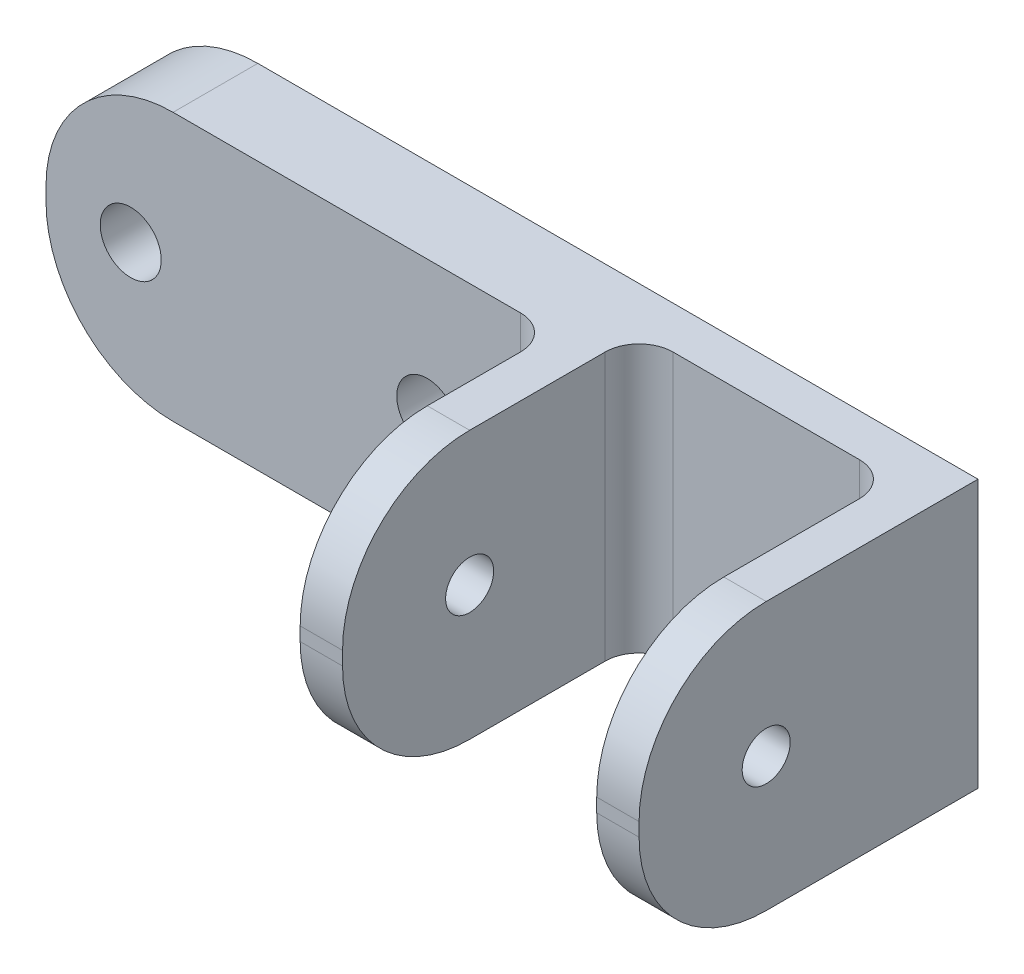
ISO-10303-21;
HEADER;
FILE_DESCRIPTION(('STEP AP214'),'2;1');
FILE_NAME('part.step','',(''),(''),'','','');
FILE_SCHEMA(('AUTOMOTIVE_DESIGN { 1 0 10303 214 1 1 1 1 }'));
ENDSEC;
DATA;
#1=APPLICATION_CONTEXT('core data for automotive mechanical design processes');
#2=APPLICATION_PROTOCOL_DEFINITION('international standard','automotive_design',2000,#1);
#3=PRODUCT_CONTEXT('',#1,'mechanical');
#4=PRODUCT('Part','Part','',(#3));
#5=PRODUCT_RELATED_PRODUCT_CATEGORY('part','',(#4));
#6=PRODUCT_DEFINITION_FORMATION('','',#4);
#7=PRODUCT_DEFINITION_CONTEXT('part definition',#1,'design');
#8=PRODUCT_DEFINITION('design','',#6,#7);
#9=PRODUCT_DEFINITION_SHAPE('','',#8);
#10=(LENGTH_UNIT() NAMED_UNIT(*) SI_UNIT(.MILLI.,.METRE.));
#11=(NAMED_UNIT(*) PLANE_ANGLE_UNIT() SI_UNIT($,.RADIAN.));
#12=(NAMED_UNIT(*) SI_UNIT($,.STERADIAN.) SOLID_ANGLE_UNIT());
#13=UNCERTAINTY_MEASURE_WITH_UNIT(LENGTH_MEASURE(1.E-05),#10,'distance_accuracy_value','');
#14=(GEOMETRIC_REPRESENTATION_CONTEXT(3) GLOBAL_UNCERTAINTY_ASSIGNED_CONTEXT((#13)) GLOBAL_UNIT_ASSIGNED_CONTEXT((#10,
#11,#12)) REPRESENTATION_CONTEXT('',''));
#15=CARTESIAN_POINT('',(0.,0.,0.));
#16=DIRECTION('',(0.,0.,1.));
#17=DIRECTION('',(1.,0.,0.));
#18=AXIS2_PLACEMENT_3D('',#15,#16,#17);
#19=CARTESIAN_POINT('',(0.,0.,6.35));
#20=DIRECTION('',(0.,0.,-1.));
#21=DIRECTION('',(-1.,0.,0.));
#22=AXIS2_PLACEMENT_3D('',#19,#20,#21);
#23=PLANE('',#22);
#24=CARTESIAN_POINT('',(-3.17500000000002,0.,6.35));
#25=DIRECTION('',(0.,0.,1.));
#26=DIRECTION('',(1.,0.,0.));
#27=AXIS2_PLACEMENT_3D('',#24,#25,#26);
#28=CIRCLE('',#27,2.286);
#29=CARTESIAN_POINT('',(-0.889000000000021,0.,6.35));
#30=VERTEX_POINT('',#29);
#31=EDGE_CURVE('E451',#30,#30,#28,.T.);
#32=ORIENTED_EDGE('',*,*,#31,.F.);
#33=EDGE_LOOP('',(#32));
#34=FACE_BOUND('',#33,.T.);
#35=CARTESIAN_POINT('',(-25.4,0.,6.35));
#36=DIRECTION('',(0.,0.,1.));
#37=DIRECTION('',(1.,0.,0.));
#38=AXIS2_PLACEMENT_3D('',#35,#36,#37);
#39=CIRCLE('',#38,2.286);
#40=CARTESIAN_POINT('',(-23.114,0.,6.35));
#41=VERTEX_POINT('',#40);
#42=EDGE_CURVE('E444',#41,#41,#39,.T.);
#43=ORIENTED_EDGE('',*,*,#42,.F.);
#44=EDGE_LOOP('',(#43));
#45=FACE_BOUND('',#44,.T.);
#46=DIRECTION('',(0.,-1.,0.));
#47=VECTOR('',#46,1.);
#48=CARTESIAN_POINT('',(-31.75,-10.033,6.35));
#49=LINE('',#48,#47);
#50=CARTESIAN_POINT('',(-31.75,0.508,6.35));
#51=VERTEX_POINT('',#50);
#52=CARTESIAN_POINT('',(-31.75,-0.508,6.35));
#53=VERTEX_POINT('',#52);
#54=EDGE_CURVE('E306',#51,#53,#49,.T.);
#55=ORIENTED_EDGE('',*,*,#54,.T.);
#56=CARTESIAN_POINT('',(-22.225,-0.508,6.35));
#57=DIRECTION('',(0.,0.,-1.));
#58=DIRECTION('',(-1.,0.,0.));
#59=AXIS2_PLACEMENT_3D('',#56,#57,#58);
#60=CIRCLE('',#59,9.525);
#61=CARTESIAN_POINT('',(-22.225,-10.033,6.35));
#62=VERTEX_POINT('',#61);
#63=EDGE_CURVE('E258',#53,#62,#60,.F.);
#64=ORIENTED_EDGE('',*,*,#63,.T.);
#65=DIRECTION('',(1.,0.,0.));
#66=VECTOR('',#65,1.);
#67=CARTESIAN_POINT('',(-31.75,-10.033,6.35));
#68=LINE('',#67,#66);
#69=CARTESIAN_POINT('',(3.80999999999998,-10.033,6.35));
#70=VERTEX_POINT('',#69);
#71=EDGE_CURVE('E196',#62,#70,#68,.T.);
#72=ORIENTED_EDGE('',*,*,#71,.T.);
#73=DIRECTION('',(0.,-1.,0.));
#74=VECTOR('',#73,1.);
#75=CARTESIAN_POINT('',(3.80999999999998,10.033,6.35));
#76=LINE('',#75,#74);
#77=CARTESIAN_POINT('',(3.80999999999998,10.033,6.35));
#78=VERTEX_POINT('',#77);
#79=EDGE_CURVE('E224',#70,#78,#76,.F.);
#80=ORIENTED_EDGE('',*,*,#79,.T.);
#81=DIRECTION('',(-1.,0.,0.));
#82=VECTOR('',#81,1.);
#83=CARTESIAN_POINT('',(-31.75,10.033,6.35));
#84=LINE('',#83,#82);
#85=CARTESIAN_POINT('',(-22.225,10.033,6.35));
#86=VERTEX_POINT('',#85);
#87=EDGE_CURVE('E203',#78,#86,#84,.T.);
#88=ORIENTED_EDGE('',*,*,#87,.T.);
#89=CARTESIAN_POINT('',(-22.225,0.508,6.35));
#90=DIRECTION('',(0.,0.,-1.));
#91=DIRECTION('',(-1.,0.,0.));
#92=AXIS2_PLACEMENT_3D('',#89,#90,#91);
#93=CIRCLE('',#92,9.525);
#94=EDGE_CURVE('E256',#86,#51,#93,.F.);
#95=ORIENTED_EDGE('',*,*,#94,.T.);
#96=EDGE_LOOP('',(#55,#64,#72,#80,#88,#95));
#97=FACE_BOUND('',#96,.T.);
#98=ADVANCED_FACE('F33',(#34,#45,#97),#23,.F.);
#99=CARTESIAN_POINT('',(31.75,-10.033,6.35));
#100=DIRECTION('',(-1.,0.,0.));
#101=DIRECTION('',(0.,0.,1.));
#102=AXIS2_PLACEMENT_3D('',#99,#100,#101);
#103=PLANE('',#102);
#104=CARTESIAN_POINT('',(31.75,0.,15.875));
#105=DIRECTION('',(-1.,0.,0.));
#106=DIRECTION('',(0.,0.,1.));
#107=AXIS2_PLACEMENT_3D('',#104,#105,#106);
#108=CIRCLE('',#107,1.8);
#109=CARTESIAN_POINT('',(31.75,0.,17.675));
#110=VERTEX_POINT('',#109);
#111=EDGE_CURVE('E209',#110,#110,#108,.T.);
#112=ORIENTED_EDGE('',*,*,#111,.T.);
#113=EDGE_LOOP('',(#112));
#114=FACE_BOUND('',#113,.T.);
#115=DIRECTION('',(0.,-1.,0.));
#116=VECTOR('',#115,1.);
#117=CARTESIAN_POINT('',(31.75,-10.033,25.4));
#118=LINE('',#117,#116);
#119=CARTESIAN_POINT('',(31.75,0.508,25.4));
#120=VERTEX_POINT('',#119);
#121=CARTESIAN_POINT('',(31.75,-0.508,25.4));
#122=VERTEX_POINT('',#121);
#123=EDGE_CURVE('E293',#120,#122,#118,.T.);
#124=ORIENTED_EDGE('',*,*,#123,.T.);
#125=CARTESIAN_POINT('',(31.75,-0.508,15.875));
#126=DIRECTION('',(-1.,0.,0.));
#127=DIRECTION('',(0.,0.,1.));
#128=AXIS2_PLACEMENT_3D('',#125,#126,#127);
#129=CIRCLE('',#128,9.525);
#130=CARTESIAN_POINT('',(31.75,-10.033,15.875));
#131=VERTEX_POINT('',#130);
#132=EDGE_CURVE('E285',#122,#131,#129,.F.);
#133=ORIENTED_EDGE('',*,*,#132,.T.);
#134=DIRECTION('',(0.,0.,-1.));
#135=VECTOR('',#134,1.);
#136=CARTESIAN_POINT('',(31.75,-10.033,6.35));
#137=LINE('',#136,#135);
#138=CARTESIAN_POINT('',(31.75,-10.033,0.));
#139=VERTEX_POINT('',#138);
#140=EDGE_CURVE('E176',#131,#139,#137,.T.);
#141=ORIENTED_EDGE('',*,*,#140,.T.);
#142=DIRECTION('',(0.,1.,0.));
#143=VECTOR('',#142,1.);
#144=CARTESIAN_POINT('',(31.75,-10.033,0.));
#145=LINE('',#144,#143);
#146=CARTESIAN_POINT('',(31.75,10.033,0.));
#147=VERTEX_POINT('',#146);
#148=EDGE_CURVE('E182',#139,#147,#145,.T.);
#149=ORIENTED_EDGE('',*,*,#148,.T.);
#150=DIRECTION('',(0.,0.,-1.));
#151=VECTOR('',#150,1.);
#152=CARTESIAN_POINT('',(31.75,10.033,6.35));
#153=LINE('',#152,#151);
#154=CARTESIAN_POINT('',(31.75,10.033,15.875));
#155=VERTEX_POINT('',#154);
#156=EDGE_CURVE('E165',#155,#147,#153,.T.);
#157=ORIENTED_EDGE('',*,*,#156,.F.);
#158=CARTESIAN_POINT('',(31.75,0.508,15.875));
#159=DIRECTION('',(-1.,0.,0.));
#160=DIRECTION('',(0.,0.,1.));
#161=AXIS2_PLACEMENT_3D('',#158,#159,#160);
#162=CIRCLE('',#161,9.525);
#163=EDGE_CURVE('E283',#155,#120,#162,.F.);
#164=ORIENTED_EDGE('',*,*,#163,.T.);
#165=EDGE_LOOP('',(#124,#133,#141,#149,#157,#164));
#166=FACE_BOUND('',#165,.T.);
#167=ADVANCED_FACE('F188',(#114,#166),#103,.F.);
#168=CARTESIAN_POINT('',(-31.75,10.033,6.35));
#169=DIRECTION('',(0.,-1.,0.));
#170=DIRECTION('',(0.,0.,-1.));
#171=AXIS2_PLACEMENT_3D('',#168,#169,#170);
#172=PLANE('',#171);
#173=DIRECTION('',(-1.,0.,0.));
#174=VECTOR('',#173,1.);
#175=CARTESIAN_POINT('',(-31.75,10.033,0.));
#176=LINE('',#175,#174);
#177=CARTESIAN_POINT('',(-22.225,10.033,0.));
#178=VERTEX_POINT('',#177);
#179=EDGE_CURVE('E168',#147,#178,#176,.T.);
#180=ORIENTED_EDGE('',*,*,#179,.T.);
#181=DIRECTION('',(0.,0.,-1.));
#182=VECTOR('',#181,1.);
#183=CARTESIAN_POINT('',(-22.225,10.033,6.35));
#184=LINE('',#183,#182);
#185=EDGE_CURVE('E263',#178,#86,#184,.F.);
#186=ORIENTED_EDGE('',*,*,#185,.T.);
#187=ORIENTED_EDGE('',*,*,#87,.F.);
#188=CARTESIAN_POINT('',(3.80999999999998,10.033,8.89));
#189=DIRECTION('',(0.,-1.,0.));
#190=DIRECTION('',(0.,0.,-1.));
#191=AXIS2_PLACEMENT_3D('',#188,#189,#190);
#192=CIRCLE('',#191,2.54);
#193=CARTESIAN_POINT('',(6.34999999999998,10.033,8.89));
#194=VERTEX_POINT('',#193);
#195=EDGE_CURVE('E238',#78,#194,#192,.T.);
#196=ORIENTED_EDGE('',*,*,#195,.T.);
#197=DIRECTION('',(0.,0.,-1.));
#198=VECTOR('',#197,1.);
#199=CARTESIAN_POINT('',(6.34999999999998,10.033,45.7156339059356));
#200=LINE('',#199,#198);
#201=CARTESIAN_POINT('',(6.34999999999998,10.033,15.875));
#202=VERTEX_POINT('',#201);
#203=EDGE_CURVE('E325',#202,#194,#200,.T.);
#204=ORIENTED_EDGE('',*,*,#203,.F.);
#205=DIRECTION('',(-1.,0.,0.));
#206=VECTOR('',#205,1.);
#207=CARTESIAN_POINT('',(9.52499999999998,10.033,15.875));
#208=LINE('',#207,#206);
#209=CARTESIAN_POINT('',(9.52499999999998,10.033,15.875));
#210=VERTEX_POINT('',#209);
#211=EDGE_CURVE('E260',#202,#210,#208,.F.);
#212=ORIENTED_EDGE('',*,*,#211,.T.);
#213=DIRECTION('',(0.,0.,-1.));
#214=VECTOR('',#213,1.);
#215=CARTESIAN_POINT('',(9.52499999999998,10.033,45.7156339059356));
#216=LINE('',#215,#214);
#217=CARTESIAN_POINT('',(9.52499999999998,10.033,5.715));
#218=VERTEX_POINT('',#217);
#219=EDGE_CURVE('E421',#210,#218,#216,.T.);
#220=ORIENTED_EDGE('',*,*,#219,.T.);
#221=CARTESIAN_POINT('',(12.065,10.033,5.715));
#222=DIRECTION('',(0.,-1.,0.));
#223=DIRECTION('',(0.,0.,-1.));
#224=AXIS2_PLACEMENT_3D('',#221,#222,#223);
#225=CIRCLE('',#224,2.54);
#226=CARTESIAN_POINT('',(12.065,10.033,3.175));
#227=VERTEX_POINT('',#226);
#228=EDGE_CURVE('E233',#218,#227,#225,.T.);
#229=ORIENTED_EDGE('',*,*,#228,.T.);
#230=DIRECTION('',(-1.,0.,0.));
#231=VECTOR('',#230,1.);
#232=CARTESIAN_POINT('',(28.575,10.033,3.175));
#233=LINE('',#232,#231);
#234=CARTESIAN_POINT('',(26.035,10.033,3.175));
#235=VERTEX_POINT('',#234);
#236=EDGE_CURVE('E458',#235,#227,#233,.T.);
#237=ORIENTED_EDGE('',*,*,#236,.F.);
#238=CARTESIAN_POINT('',(26.035,10.033,5.715));
#239=DIRECTION('',(0.,-1.,0.));
#240=DIRECTION('',(0.,0.,-1.));
#241=AXIS2_PLACEMENT_3D('',#238,#239,#240);
#242=CIRCLE('',#241,2.54);
#243=CARTESIAN_POINT('',(28.575,10.033,5.715));
#244=VERTEX_POINT('',#243);
#245=EDGE_CURVE('E226',#235,#244,#242,.T.);
#246=ORIENTED_EDGE('',*,*,#245,.T.);
#247=DIRECTION('',(0.,0.,1.));
#248=VECTOR('',#247,1.);
#249=CARTESIAN_POINT('',(28.575,10.033,0.));
#250=LINE('',#249,#248);
#251=CARTESIAN_POINT('',(28.575,10.033,15.875));
#252=VERTEX_POINT('',#251);
#253=EDGE_CURVE('E289',#244,#252,#250,.T.);
#254=ORIENTED_EDGE('',*,*,#253,.T.);
#255=DIRECTION('',(1.,0.,0.));
#256=VECTOR('',#255,1.);
#257=CARTESIAN_POINT('',(31.75,10.033,15.875));
#258=LINE('',#257,#256);
#259=EDGE_CURVE('E172',#252,#155,#258,.T.);
#260=ORIENTED_EDGE('',*,*,#259,.T.);
#261=ORIENTED_EDGE('',*,*,#156,.T.);
#262=EDGE_LOOP('',(#180,#186,#187,#196,#204,#212,#220,#229,#237,#246,#254,#260,#261));
#263=FACE_BOUND('',#262,.T.);
#264=ADVANCED_FACE('F167',(#263),#172,.F.);
#265=CARTESIAN_POINT('',(-31.75,-10.033,6.35));
#266=DIRECTION('',(1.,0.,0.));
#267=DIRECTION('',(0.,0.,-1.));
#268=AXIS2_PLACEMENT_3D('',#265,#266,#267);
#269=PLANE('',#268);
#270=DIRECTION('',(0.,-1.,0.));
#271=VECTOR('',#270,1.);
#272=CARTESIAN_POINT('',(-31.75,-10.033,0.));
#273=LINE('',#272,#271);
#274=CARTESIAN_POINT('',(-31.75,0.508,0.));
#275=VERTEX_POINT('',#274);
#276=CARTESIAN_POINT('',(-31.75,-0.508,0.));
#277=VERTEX_POINT('',#276);
#278=EDGE_CURVE('E185',#275,#277,#273,.T.);
#279=ORIENTED_EDGE('',*,*,#278,.T.);
#280=DIRECTION('',(0.,0.,-1.));
#281=VECTOR('',#280,1.);
#282=CARTESIAN_POINT('',(-31.75,-0.508,6.35));
#283=LINE('',#282,#281);
#284=EDGE_CURVE('E254',#277,#53,#283,.F.);
#285=ORIENTED_EDGE('',*,*,#284,.T.);
#286=ORIENTED_EDGE('',*,*,#54,.F.);
#287=DIRECTION('',(0.,0.,-1.));
#288=VECTOR('',#287,1.);
#289=CARTESIAN_POINT('',(-31.75,0.508,6.35));
#290=LINE('',#289,#288);
#291=EDGE_CURVE('E251',#51,#275,#290,.T.);
#292=ORIENTED_EDGE('',*,*,#291,.T.);
#293=EDGE_LOOP('',(#279,#285,#286,#292));
#294=FACE_BOUND('',#293,.T.);
#295=ADVANCED_FACE('F332',(#294),#269,.F.);
#296=CARTESIAN_POINT('',(-31.75,-10.033,6.35));
#297=DIRECTION('',(0.,1.,0.));
#298=DIRECTION('',(0.,0.,1.));
#299=AXIS2_PLACEMENT_3D('',#296,#297,#298);
#300=PLANE('',#299);
#301=ORIENTED_EDGE('',*,*,#71,.F.);
#302=DIRECTION('',(0.,0.,-1.));
#303=VECTOR('',#302,1.);
#304=CARTESIAN_POINT('',(-22.225,-10.033,6.35));
#305=LINE('',#304,#303);
#306=CARTESIAN_POINT('',(-22.225,-10.033,0.));
#307=VERTEX_POINT('',#306);
#308=EDGE_CURVE('E245',#62,#307,#305,.T.);
#309=ORIENTED_EDGE('',*,*,#308,.T.);
#310=DIRECTION('',(1.,0.,0.));
#311=VECTOR('',#310,1.);
#312=CARTESIAN_POINT('',(-31.75,-10.033,0.));
#313=LINE('',#312,#311);
#314=EDGE_CURVE('E201',#307,#139,#313,.T.);
#315=ORIENTED_EDGE('',*,*,#314,.T.);
#316=ORIENTED_EDGE('',*,*,#140,.F.);
#317=DIRECTION('',(1.,0.,0.));
#318=VECTOR('',#317,1.);
#319=CARTESIAN_POINT('',(28.575,-10.033,15.875));
#320=LINE('',#319,#318);
#321=CARTESIAN_POINT('',(28.575,-10.033,15.875));
#322=VERTEX_POINT('',#321);
#323=EDGE_CURVE('E241',#131,#322,#320,.F.);
#324=ORIENTED_EDGE('',*,*,#323,.T.);
#325=DIRECTION('',(0.,0.,-1.));
#326=VECTOR('',#325,1.);
#327=CARTESIAN_POINT('',(28.575,-10.033,0.));
#328=LINE('',#327,#326);
#329=CARTESIAN_POINT('',(28.575,-10.033,5.715));
#330=VERTEX_POINT('',#329);
#331=EDGE_CURVE('E191',#322,#330,#328,.T.);
#332=ORIENTED_EDGE('',*,*,#331,.T.);
#333=CARTESIAN_POINT('',(26.035,-10.033,5.715));
#334=DIRECTION('',(0.,1.,0.));
#335=DIRECTION('',(0.,0.,1.));
#336=AXIS2_PLACEMENT_3D('',#333,#334,#335);
#337=CIRCLE('',#336,2.54);
#338=CARTESIAN_POINT('',(26.035,-10.033,3.175));
#339=VERTEX_POINT('',#338);
#340=EDGE_CURVE('E228',#330,#339,#337,.T.);
#341=ORIENTED_EDGE('',*,*,#340,.T.);
#342=DIRECTION('',(1.,0.,0.));
#343=VECTOR('',#342,1.);
#344=CARTESIAN_POINT('',(9.52499999999998,-10.033,3.175));
#345=LINE('',#344,#343);
#346=CARTESIAN_POINT('',(12.065,-10.033,3.175));
#347=VERTEX_POINT('',#346);
#348=EDGE_CURVE('E448',#347,#339,#345,.T.);
#349=ORIENTED_EDGE('',*,*,#348,.F.);
#350=CARTESIAN_POINT('',(12.065,-10.033,5.715));
#351=DIRECTION('',(0.,1.,0.));
#352=DIRECTION('',(0.,0.,1.));
#353=AXIS2_PLACEMENT_3D('',#350,#351,#352);
#354=CIRCLE('',#353,2.54);
#355=CARTESIAN_POINT('',(9.52499999999998,-10.033,5.715));
#356=VERTEX_POINT('',#355);
#357=EDGE_CURVE('E230',#347,#356,#354,.T.);
#358=ORIENTED_EDGE('',*,*,#357,.T.);
#359=DIRECTION('',(0.,0.,-1.));
#360=VECTOR('',#359,1.);
#361=CARTESIAN_POINT('',(9.52499999999998,-10.033,45.7156339059356));
#362=LINE('',#361,#360);
#363=CARTESIAN_POINT('',(9.52499999999998,-10.033,15.875));
#364=VERTEX_POINT('',#363);
#365=EDGE_CURVE('E431',#364,#356,#362,.T.);
#366=ORIENTED_EDGE('',*,*,#365,.F.);
#367=DIRECTION('',(1.,0.,0.));
#368=VECTOR('',#367,1.);
#369=CARTESIAN_POINT('',(6.34999999999998,-10.033,15.875));
#370=LINE('',#369,#368);
#371=CARTESIAN_POINT('',(6.34999999999998,-10.033,15.875));
#372=VERTEX_POINT('',#371);
#373=EDGE_CURVE('E243',#364,#372,#370,.F.);
#374=ORIENTED_EDGE('',*,*,#373,.T.);
#375=DIRECTION('',(0.,0.,-1.));
#376=VECTOR('',#375,1.);
#377=CARTESIAN_POINT('',(6.34999999999998,-10.033,45.7156339059356));
#378=LINE('',#377,#376);
#379=CARTESIAN_POINT('',(6.34999999999998,-10.033,8.89));
#380=VERTEX_POINT('',#379);
#381=EDGE_CURVE('E319',#372,#380,#378,.T.);
#382=ORIENTED_EDGE('',*,*,#381,.T.);
#383=CARTESIAN_POINT('',(3.80999999999998,-10.033,8.89));
#384=DIRECTION('',(0.,1.,0.));
#385=DIRECTION('',(0.,0.,1.));
#386=AXIS2_PLACEMENT_3D('',#383,#384,#385);
#387=CIRCLE('',#386,2.54);
#388=EDGE_CURVE('E235',#380,#70,#387,.T.);
#389=ORIENTED_EDGE('',*,*,#388,.T.);
#390=EDGE_LOOP('',(#301,#309,#315,#316,#324,#332,#341,#349,#358,#366,#374,#382,#389));
#391=FACE_BOUND('',#390,.T.);
#392=ADVANCED_FACE('F317',(#391),#300,.F.);
#393=CARTESIAN_POINT('',(0.,0.,0.));
#394=DIRECTION('',(0.,0.,-1.));
#395=DIRECTION('',(-1.,0.,0.));
#396=AXIS2_PLACEMENT_3D('',#393,#394,#395);
#397=PLANE('',#396);
#398=CARTESIAN_POINT('',(-3.17500000000002,0.,0.));
#399=DIRECTION('',(0.,0.,1.));
#400=DIRECTION('',(1.,0.,0.));
#401=AXIS2_PLACEMENT_3D('',#398,#399,#400);
#402=CIRCLE('',#401,2.286);
#403=CARTESIAN_POINT('',(-0.889000000000021,0.,0.));
#404=VERTEX_POINT('',#403);
#405=EDGE_CURVE('E443',#404,#404,#402,.T.);
#406=ORIENTED_EDGE('',*,*,#405,.T.);
#407=EDGE_LOOP('',(#406));
#408=FACE_BOUND('',#407,.T.);
#409=CARTESIAN_POINT('',(-25.4,0.,0.));
#410=DIRECTION('',(0.,0.,1.));
#411=DIRECTION('',(1.,0.,0.));
#412=AXIS2_PLACEMENT_3D('',#409,#410,#411);
#413=CIRCLE('',#412,2.286);
#414=CARTESIAN_POINT('',(-23.114,0.,0.));
#415=VERTEX_POINT('',#414);
#416=EDGE_CURVE('E447',#415,#415,#413,.T.);
#417=ORIENTED_EDGE('',*,*,#416,.T.);
#418=EDGE_LOOP('',(#417));
#419=FACE_BOUND('',#418,.T.);
#420=ORIENTED_EDGE('',*,*,#314,.F.);
#421=CARTESIAN_POINT('',(-22.225,-0.508,0.));
#422=DIRECTION('',(0.,0.,-1.));
#423=DIRECTION('',(-1.,0.,0.));
#424=AXIS2_PLACEMENT_3D('',#421,#422,#423);
#425=CIRCLE('',#424,9.525);
#426=EDGE_CURVE('E249',#307,#277,#425,.T.);
#427=ORIENTED_EDGE('',*,*,#426,.T.);
#428=ORIENTED_EDGE('',*,*,#278,.F.);
#429=CARTESIAN_POINT('',(-22.225,0.508,0.));
#430=DIRECTION('',(0.,0.,-1.));
#431=DIRECTION('',(-1.,0.,0.));
#432=AXIS2_PLACEMENT_3D('',#429,#430,#431);
#433=CIRCLE('',#432,9.525);
#434=EDGE_CURVE('E184',#275,#178,#433,.T.);
#435=ORIENTED_EDGE('',*,*,#434,.T.);
#436=ORIENTED_EDGE('',*,*,#179,.F.);
#437=ORIENTED_EDGE('',*,*,#148,.F.);
#438=EDGE_LOOP('',(#420,#427,#428,#435,#436,#437));
#439=FACE_BOUND('',#438,.T.);
#440=ADVANCED_FACE('F181',(#408,#419,#439),#397,.T.);
#441=CARTESIAN_POINT('',(28.575,0.,0.));
#442=DIRECTION('',(1.,0.,0.));
#443=DIRECTION('',(0.,0.,-1.));
#444=AXIS2_PLACEMENT_3D('',#441,#442,#443);
#445=PLANE('',#444);
#446=CARTESIAN_POINT('',(28.575,0.,15.875));
#447=DIRECTION('',(1.,0.,0.));
#448=DIRECTION('',(0.,0.,-1.));
#449=AXIS2_PLACEMENT_3D('',#446,#447,#448);
#450=CIRCLE('',#449,1.8);
#451=CARTESIAN_POINT('',(28.575,0.,14.075));
#452=VERTEX_POINT('',#451);
#453=EDGE_CURVE('E433',#452,#452,#450,.T.);
#454=ORIENTED_EDGE('',*,*,#453,.T.);
#455=EDGE_LOOP('',(#454));
#456=FACE_BOUND('',#455,.T.);
#457=ORIENTED_EDGE('',*,*,#331,.F.);
#458=CARTESIAN_POINT('',(28.575,-0.508,15.875));
#459=DIRECTION('',(1.,0.,0.));
#460=DIRECTION('',(0.,0.,-1.));
#461=AXIS2_PLACEMENT_3D('',#458,#459,#460);
#462=CIRCLE('',#461,9.525);
#463=CARTESIAN_POINT('',(28.575,-0.508,25.4));
#464=VERTEX_POINT('',#463);
#465=EDGE_CURVE('E11',#322,#464,#462,.F.);
#466=ORIENTED_EDGE('',*,*,#465,.T.);
#467=DIRECTION('',(0.,-1.,0.));
#468=VECTOR('',#467,1.);
#469=CARTESIAN_POINT('',(28.575,-10.033,25.4));
#470=LINE('',#469,#468);
#471=CARTESIAN_POINT('',(28.575,0.508,25.4));
#472=VERTEX_POINT('',#471);
#473=EDGE_CURVE('E193',#472,#464,#470,.T.);
#474=ORIENTED_EDGE('',*,*,#473,.F.);
#475=CARTESIAN_POINT('',(28.575,0.508,15.875));
#476=DIRECTION('',(1.,0.,0.));
#477=DIRECTION('',(0.,0.,-1.));
#478=AXIS2_PLACEMENT_3D('',#475,#476,#477);
#479=CIRCLE('',#478,9.525);
#480=EDGE_CURVE('E41',#472,#252,#479,.F.);
#481=ORIENTED_EDGE('',*,*,#480,.T.);
#482=ORIENTED_EDGE('',*,*,#253,.F.);
#483=DIRECTION('',(0.,1.,0.));
#484=VECTOR('',#483,1.);
#485=CARTESIAN_POINT('',(28.575,0.,5.715));
#486=LINE('',#485,#484);
#487=EDGE_CURVE('E215',#244,#330,#486,.F.);
#488=ORIENTED_EDGE('',*,*,#487,.T.);
#489=EDGE_LOOP('',(#457,#466,#474,#481,#482,#488));
#490=FACE_BOUND('',#489,.T.);
#491=ADVANCED_FACE('F288',(#456,#490),#445,.F.);
#492=CARTESIAN_POINT('',(28.575,-10.033,25.4));
#493=DIRECTION('',(0.,0.,1.));
#494=DIRECTION('',(1.,0.,0.));
#495=AXIS2_PLACEMENT_3D('',#492,#493,#494);
#496=PLANE('',#495);
#497=ORIENTED_EDGE('',*,*,#473,.T.);
#498=DIRECTION('',(1.,0.,0.));
#499=VECTOR('',#498,1.);
#500=CARTESIAN_POINT('',(31.75,-0.508,25.4));
#501=LINE('',#500,#499);
#502=EDGE_CURVE('E280',#464,#122,#501,.T.);
#503=ORIENTED_EDGE('',*,*,#502,.T.);
#504=ORIENTED_EDGE('',*,*,#123,.F.);
#505=DIRECTION('',(1.,0.,0.));
#506=VECTOR('',#505,1.);
#507=CARTESIAN_POINT('',(28.575,0.508,25.4));
#508=LINE('',#507,#506);
#509=EDGE_CURVE('E53',#120,#472,#508,.F.);
#510=ORIENTED_EDGE('',*,*,#509,.T.);
#511=EDGE_LOOP('',(#497,#503,#504,#510));
#512=FACE_BOUND('',#511,.T.);
#513=ADVANCED_FACE('F296',(#512),#496,.T.);
#514=CARTESIAN_POINT('',(9.52499999999998,10.033,45.7156339059356));
#515=DIRECTION('',(-1.,0.,0.));
#516=DIRECTION('',(0.,-1.,0.));
#517=AXIS2_PLACEMENT_3D('',#514,#515,#516);
#518=PLANE('',#517);
#519=CARTESIAN_POINT('',(9.52499999999998,0.,15.875));
#520=DIRECTION('',(-1.,0.,0.));
#521=DIRECTION('',(0.,-1.,0.));
#522=AXIS2_PLACEMENT_3D('',#519,#520,#521);
#523=CIRCLE('',#522,1.8);
#524=CARTESIAN_POINT('',(9.52499999999998,-1.8,15.875));
#525=VERTEX_POINT('',#524);
#526=EDGE_CURVE('E208',#525,#525,#523,.T.);
#527=ORIENTED_EDGE('',*,*,#526,.T.);
#528=EDGE_LOOP('',(#527));
#529=FACE_BOUND('',#528,.T.);
#530=DIRECTION('',(0.,1.,0.));
#531=VECTOR('',#530,1.);
#532=CARTESIAN_POINT('',(9.52499999999998,10.033,25.4));
#533=LINE('',#532,#531);
#534=CARTESIAN_POINT('',(9.52499999999998,-0.508,25.4));
#535=VERTEX_POINT('',#534);
#536=CARTESIAN_POINT('',(9.52499999999998,0.508,25.4));
#537=VERTEX_POINT('',#536);
#538=EDGE_CURVE('E301',#535,#537,#533,.T.);
#539=ORIENTED_EDGE('',*,*,#538,.F.);
#540=CARTESIAN_POINT('',(9.52499999999998,-0.508,15.875));
#541=DIRECTION('',(-1.,0.,0.));
#542=DIRECTION('',(0.,-1.,0.));
#543=AXIS2_PLACEMENT_3D('',#540,#541,#542);
#544=CIRCLE('',#543,9.525);
#545=EDGE_CURVE('E273',#535,#364,#544,.F.);
#546=ORIENTED_EDGE('',*,*,#545,.T.);
#547=ORIENTED_EDGE('',*,*,#365,.T.);
#548=DIRECTION('',(0.,-1.,0.));
#549=VECTOR('',#548,1.);
#550=CARTESIAN_POINT('',(9.52499999999998,10.033,5.715));
#551=LINE('',#550,#549);
#552=EDGE_CURVE('E218',#356,#218,#551,.F.);
#553=ORIENTED_EDGE('',*,*,#552,.T.);
#554=ORIENTED_EDGE('',*,*,#219,.F.);
#555=CARTESIAN_POINT('',(9.52499999999998,0.508,15.875));
#556=DIRECTION('',(-1.,0.,0.));
#557=DIRECTION('',(0.,-1.,0.));
#558=AXIS2_PLACEMENT_3D('',#555,#556,#557);
#559=CIRCLE('',#558,9.525);
#560=EDGE_CURVE('E271',#210,#537,#559,.F.);
#561=ORIENTED_EDGE('',*,*,#560,.T.);
#562=EDGE_LOOP('',(#539,#546,#547,#553,#554,#561));
#563=FACE_BOUND('',#562,.T.);
#564=ADVANCED_FACE('F420',(#529,#563),#518,.F.);
#565=CARTESIAN_POINT('',(6.34999999999998,10.033,45.7156339059356));
#566=DIRECTION('',(1.,0.,0.));
#567=DIRECTION('',(0.,1.,0.));
#568=AXIS2_PLACEMENT_3D('',#565,#566,#567);
#569=PLANE('',#568);
#570=CARTESIAN_POINT('',(6.34999999999998,0.,15.875));
#571=DIRECTION('',(1.,0.,0.));
#572=DIRECTION('',(0.,1.,0.));
#573=AXIS2_PLACEMENT_3D('',#570,#571,#572);
#574=CIRCLE('',#573,1.8);
#575=CARTESIAN_POINT('',(6.34999999999998,1.8,15.875));
#576=VERTEX_POINT('',#575);
#577=EDGE_CURVE('E205',#576,#576,#574,.T.);
#578=ORIENTED_EDGE('',*,*,#577,.T.);
#579=EDGE_LOOP('',(#578));
#580=FACE_BOUND('',#579,.T.);
#581=ORIENTED_EDGE('',*,*,#381,.F.);
#582=CARTESIAN_POINT('',(6.34999999999998,-0.508,15.875));
#583=DIRECTION('',(1.,0.,0.));
#584=DIRECTION('',(0.,1.,0.));
#585=AXIS2_PLACEMENT_3D('',#582,#583,#584);
#586=CIRCLE('',#585,9.525);
#587=CARTESIAN_POINT('',(6.34999999999998,-0.508,25.4));
#588=VERTEX_POINT('',#587);
#589=EDGE_CURVE('E277',#372,#588,#586,.F.);
#590=ORIENTED_EDGE('',*,*,#589,.T.);
#591=DIRECTION('',(0.,-1.,0.));
#592=VECTOR('',#591,1.);
#593=CARTESIAN_POINT('',(6.34999999999998,10.033,25.4));
#594=LINE('',#593,#592);
#595=CARTESIAN_POINT('',(6.34999999999998,0.508,25.4));
#596=VERTEX_POINT('',#595);
#597=EDGE_CURVE('E298',#596,#588,#594,.T.);
#598=ORIENTED_EDGE('',*,*,#597,.F.);
#599=CARTESIAN_POINT('',(6.34999999999998,0.508,15.875));
#600=DIRECTION('',(1.,0.,0.));
#601=DIRECTION('',(0.,1.,0.));
#602=AXIS2_PLACEMENT_3D('',#599,#600,#601);
#603=CIRCLE('',#602,9.525);
#604=EDGE_CURVE('E275',#596,#202,#603,.F.);
#605=ORIENTED_EDGE('',*,*,#604,.T.);
#606=ORIENTED_EDGE('',*,*,#203,.T.);
#607=DIRECTION('',(0.,-1.,0.));
#608=VECTOR('',#607,1.);
#609=CARTESIAN_POINT('',(6.34999999999998,-10.033,8.89));
#610=LINE('',#609,#608);
#611=EDGE_CURVE('E221',#194,#380,#610,.T.);
#612=ORIENTED_EDGE('',*,*,#611,.T.);
#613=EDGE_LOOP('',(#581,#590,#598,#605,#606,#612));
#614=FACE_BOUND('',#613,.T.);
#615=ADVANCED_FACE('F470',(#580,#614),#569,.F.);
#616=CARTESIAN_POINT('',(28.575,-10.033,25.4));
#617=DIRECTION('',(0.,0.,1.));
#618=DIRECTION('',(1.,0.,0.));
#619=AXIS2_PLACEMENT_3D('',#616,#617,#618);
#620=PLANE('',#619);
#621=ORIENTED_EDGE('',*,*,#597,.T.);
#622=DIRECTION('',(1.,0.,0.));
#623=VECTOR('',#622,1.);
#624=CARTESIAN_POINT('',(9.52499999999998,-0.508,25.4));
#625=LINE('',#624,#623);
#626=EDGE_CURVE('E268',#588,#535,#625,.T.);
#627=ORIENTED_EDGE('',*,*,#626,.T.);
#628=ORIENTED_EDGE('',*,*,#538,.T.);
#629=DIRECTION('',(-1.,0.,0.));
#630=VECTOR('',#629,1.);
#631=CARTESIAN_POINT('',(6.34999999999998,0.508,25.4));
#632=LINE('',#631,#630);
#633=EDGE_CURVE('E265',#537,#596,#632,.T.);
#634=ORIENTED_EDGE('',*,*,#633,.T.);
#635=EDGE_LOOP('',(#621,#627,#628,#634));
#636=FACE_BOUND('',#635,.T.);
#637=ADVANCED_FACE('F423',(#636),#620,.T.);
#638=CARTESIAN_POINT('',(31.75,0.,15.875));
#639=DIRECTION('',(-1.,0.,0.));
#640=DIRECTION('',(0.,0.,1.));
#641=AXIS2_PLACEMENT_3D('',#638,#639,#640);
#642=CYLINDRICAL_SURFACE('',#641,1.8);
#643=ORIENTED_EDGE('',*,*,#577,.F.);
#644=EDGE_LOOP('',(#643));
#645=FACE_BOUND('',#644,.T.);
#646=ORIENTED_EDGE('',*,*,#526,.F.);
#647=EDGE_LOOP('',(#646));
#648=FACE_BOUND('',#647,.T.);
#649=ADVANCED_FACE('F478',(#645,#648),#642,.F.);
#650=ORIENTED_EDGE('',*,*,#111,.F.);
#651=EDGE_LOOP('',(#650));
#652=FACE_BOUND('',#651,.T.);
#653=ORIENTED_EDGE('',*,*,#453,.F.);
#654=EDGE_LOOP('',(#653));
#655=FACE_BOUND('',#654,.T.);
#656=ADVANCED_FACE('F483',(#652,#655),#642,.F.);
#657=CARTESIAN_POINT('',(-25.4,0.,0.));
#658=DIRECTION('',(0.,0.,1.));
#659=DIRECTION('',(1.,0.,0.));
#660=AXIS2_PLACEMENT_3D('',#657,#658,#659);
#661=CYLINDRICAL_SURFACE('',#660,2.286);
#662=ORIENTED_EDGE('',*,*,#416,.F.);
#663=EDGE_LOOP('',(#662));
#664=FACE_BOUND('',#663,.T.);
#665=ORIENTED_EDGE('',*,*,#42,.T.);
#666=EDGE_LOOP('',(#665));
#667=FACE_BOUND('',#666,.T.);
#668=ADVANCED_FACE('F548',(#664,#667),#661,.F.);
#669=CARTESIAN_POINT('',(-3.17500000000002,0.,0.));
#670=DIRECTION('',(0.,0.,1.));
#671=DIRECTION('',(1.,0.,0.));
#672=AXIS2_PLACEMENT_3D('',#669,#670,#671);
#673=CYLINDRICAL_SURFACE('',#672,2.286);
#674=ORIENTED_EDGE('',*,*,#405,.F.);
#675=EDGE_LOOP('',(#674));
#676=FACE_BOUND('',#675,.T.);
#677=ORIENTED_EDGE('',*,*,#31,.T.);
#678=EDGE_LOOP('',(#677));
#679=FACE_BOUND('',#678,.T.);
#680=ADVANCED_FACE('F539',(#676,#679),#673,.F.);
#681=CARTESIAN_POINT('',(0.,0.,3.175));
#682=DIRECTION('',(0.,0.,1.));
#683=DIRECTION('',(1.,0.,0.));
#684=AXIS2_PLACEMENT_3D('',#681,#682,#683);
#685=PLANE('',#684);
#686=ORIENTED_EDGE('',*,*,#348,.T.);
#687=DIRECTION('',(0.,1.,0.));
#688=VECTOR('',#687,1.);
#689=CARTESIAN_POINT('',(26.035,0.,3.175));
#690=LINE('',#689,#688);
#691=EDGE_CURVE('E212',#339,#235,#690,.T.);
#692=ORIENTED_EDGE('',*,*,#691,.T.);
#693=ORIENTED_EDGE('',*,*,#236,.T.);
#694=DIRECTION('',(0.,-1.,0.));
#695=VECTOR('',#694,1.);
#696=CARTESIAN_POINT('',(12.065,0.,3.175));
#697=LINE('',#696,#695);
#698=EDGE_CURVE('E175',#227,#347,#697,.T.);
#699=ORIENTED_EDGE('',*,*,#698,.T.);
#700=EDGE_LOOP('',(#686,#692,#693,#699));
#701=FACE_BOUND('',#700,.T.);
#702=ADVANCED_FACE('F374',(#701),#685,.T.);
#703=CARTESIAN_POINT('',(26.035,0.,5.715));
#704=DIRECTION('',(0.,1.,0.));
#705=DIRECTION('',(0.,0.,1.));
#706=AXIS2_PLACEMENT_3D('',#703,#704,#705);
#707=CYLINDRICAL_SURFACE('',#706,2.54);
#708=ORIENTED_EDGE('',*,*,#340,.F.);
#709=ORIENTED_EDGE('',*,*,#487,.F.);
#710=ORIENTED_EDGE('',*,*,#245,.F.);
#711=ORIENTED_EDGE('',*,*,#691,.F.);
#712=EDGE_LOOP('',(#708,#709,#710,#711));
#713=FACE_BOUND('',#712,.T.);
#714=ADVANCED_FACE('F370',(#713),#707,.F.);
#715=CARTESIAN_POINT('',(12.065,0.,5.715));
#716=DIRECTION('',(0.,-1.,0.));
#717=DIRECTION('',(1.,0.,0.));
#718=AXIS2_PLACEMENT_3D('',#715,#716,#717);
#719=CYLINDRICAL_SURFACE('',#718,2.54);
#720=ORIENTED_EDGE('',*,*,#228,.F.);
#721=ORIENTED_EDGE('',*,*,#552,.F.);
#722=ORIENTED_EDGE('',*,*,#357,.F.);
#723=ORIENTED_EDGE('',*,*,#698,.F.);
#724=EDGE_LOOP('',(#720,#721,#722,#723));
#725=FACE_BOUND('',#724,.T.);
#726=ADVANCED_FACE('F373',(#725),#719,.F.);
#727=CARTESIAN_POINT('',(3.80999999999998,10.033,8.89));
#728=DIRECTION('',(0.,1.,0.));
#729=DIRECTION('',(-1.,0.,0.));
#730=AXIS2_PLACEMENT_3D('',#727,#728,#729);
#731=CYLINDRICAL_SURFACE('',#730,2.54);
#732=ORIENTED_EDGE('',*,*,#195,.F.);
#733=ORIENTED_EDGE('',*,*,#79,.F.);
#734=ORIENTED_EDGE('',*,*,#388,.F.);
#735=ORIENTED_EDGE('',*,*,#611,.F.);
#736=EDGE_LOOP('',(#732,#733,#734,#735));
#737=FACE_BOUND('',#736,.T.);
#738=ADVANCED_FACE('F323',(#737),#731,.F.);
#739=CARTESIAN_POINT('',(-22.225,-0.508,6.35));
#740=DIRECTION('',(0.,0.,-1.));
#741=DIRECTION('',(-1.,0.,0.));
#742=AXIS2_PLACEMENT_3D('',#739,#740,#741);
#743=CYLINDRICAL_SURFACE('',#742,9.525);
#744=ORIENTED_EDGE('',*,*,#63,.F.);
#745=ORIENTED_EDGE('',*,*,#284,.F.);
#746=ORIENTED_EDGE('',*,*,#426,.F.);
#747=ORIENTED_EDGE('',*,*,#308,.F.);
#748=EDGE_LOOP('',(#744,#745,#746,#747));
#749=FACE_BOUND('',#748,.T.);
#750=ADVANCED_FACE('F335',(#749),#743,.T.);
#751=CARTESIAN_POINT('',(-22.225,0.508,6.35));
#752=DIRECTION('',(0.,0.,-1.));
#753=DIRECTION('',(-1.,0.,0.));
#754=AXIS2_PLACEMENT_3D('',#751,#752,#753);
#755=CYLINDRICAL_SURFACE('',#754,9.525);
#756=ORIENTED_EDGE('',*,*,#94,.F.);
#757=ORIENTED_EDGE('',*,*,#185,.F.);
#758=ORIENTED_EDGE('',*,*,#434,.F.);
#759=ORIENTED_EDGE('',*,*,#291,.F.);
#760=EDGE_LOOP('',(#756,#757,#758,#759));
#761=FACE_BOUND('',#760,.T.);
#762=ADVANCED_FACE('F330',(#761),#755,.T.);
#763=CARTESIAN_POINT('',(28.575,-0.508,15.875));
#764=DIRECTION('',(-1.,0.,0.));
#765=DIRECTION('',(0.,0.,1.));
#766=AXIS2_PLACEMENT_3D('',#763,#764,#765);
#767=CYLINDRICAL_SURFACE('',#766,9.525);
#768=ORIENTED_EDGE('',*,*,#589,.F.);
#769=ORIENTED_EDGE('',*,*,#373,.F.);
#770=ORIENTED_EDGE('',*,*,#545,.F.);
#771=ORIENTED_EDGE('',*,*,#626,.F.);
#772=EDGE_LOOP('',(#768,#769,#770,#771));
#773=FACE_BOUND('',#772,.T.);
#774=ADVANCED_FACE('F340',(#773),#767,.T.);
#775=CARTESIAN_POINT('',(28.575,-0.508,15.875));
#776=DIRECTION('',(-1.,0.,0.));
#777=DIRECTION('',(0.,0.,1.));
#778=AXIS2_PLACEMENT_3D('',#775,#776,#777);
#779=CYLINDRICAL_SURFACE('',#778,9.525);
#780=ORIENTED_EDGE('',*,*,#465,.F.);
#781=ORIENTED_EDGE('',*,*,#323,.F.);
#782=ORIENTED_EDGE('',*,*,#132,.F.);
#783=ORIENTED_EDGE('',*,*,#502,.F.);
#784=EDGE_LOOP('',(#780,#781,#782,#783));
#785=FACE_BOUND('',#784,.T.);
#786=ADVANCED_FACE('F338',(#785),#779,.T.);
#787=CARTESIAN_POINT('',(-31.75,0.508,15.875));
#788=DIRECTION('',(-1.,0.,0.));
#789=DIRECTION('',(0.,0.,1.));
#790=AXIS2_PLACEMENT_3D('',#787,#788,#789);
#791=CYLINDRICAL_SURFACE('',#790,9.525);
#792=ORIENTED_EDGE('',*,*,#480,.F.);
#793=ORIENTED_EDGE('',*,*,#509,.F.);
#794=ORIENTED_EDGE('',*,*,#163,.F.);
#795=ORIENTED_EDGE('',*,*,#259,.F.);
#796=EDGE_LOOP('',(#792,#793,#794,#795));
#797=FACE_BOUND('',#796,.T.);
#798=ADVANCED_FACE('F295',(#797),#791,.T.);
#799=CARTESIAN_POINT('',(28.575,0.508,15.875));
#800=DIRECTION('',(1.,0.,0.));
#801=DIRECTION('',(0.,0.,-1.));
#802=AXIS2_PLACEMENT_3D('',#799,#800,#801);
#803=CYLINDRICAL_SURFACE('',#802,9.525);
#804=ORIENTED_EDGE('',*,*,#560,.F.);
#805=ORIENTED_EDGE('',*,*,#211,.F.);
#806=ORIENTED_EDGE('',*,*,#604,.F.);
#807=ORIENTED_EDGE('',*,*,#633,.F.);
#808=EDGE_LOOP('',(#804,#805,#806,#807));
#809=FACE_BOUND('',#808,.T.);
#810=ADVANCED_FACE('F35',(#809),#803,.T.);
#811=CLOSED_SHELL('',(#98,#167,#264,#295,#392,#440,#491,#513,#564,#615,#637,#649,#656,#668,#680,
#702,#714,#726,#738,#750,#762,#774,#786,#798,#810));
#812=MANIFOLD_SOLID_BREP('B2',#811);
#813=ADVANCED_BREP_SHAPE_REPRESENTATION('',(#18,#812),#14);
#814=SHAPE_DEFINITION_REPRESENTATION(#9,#813);
ENDSEC;
END-ISO-10303-21;
